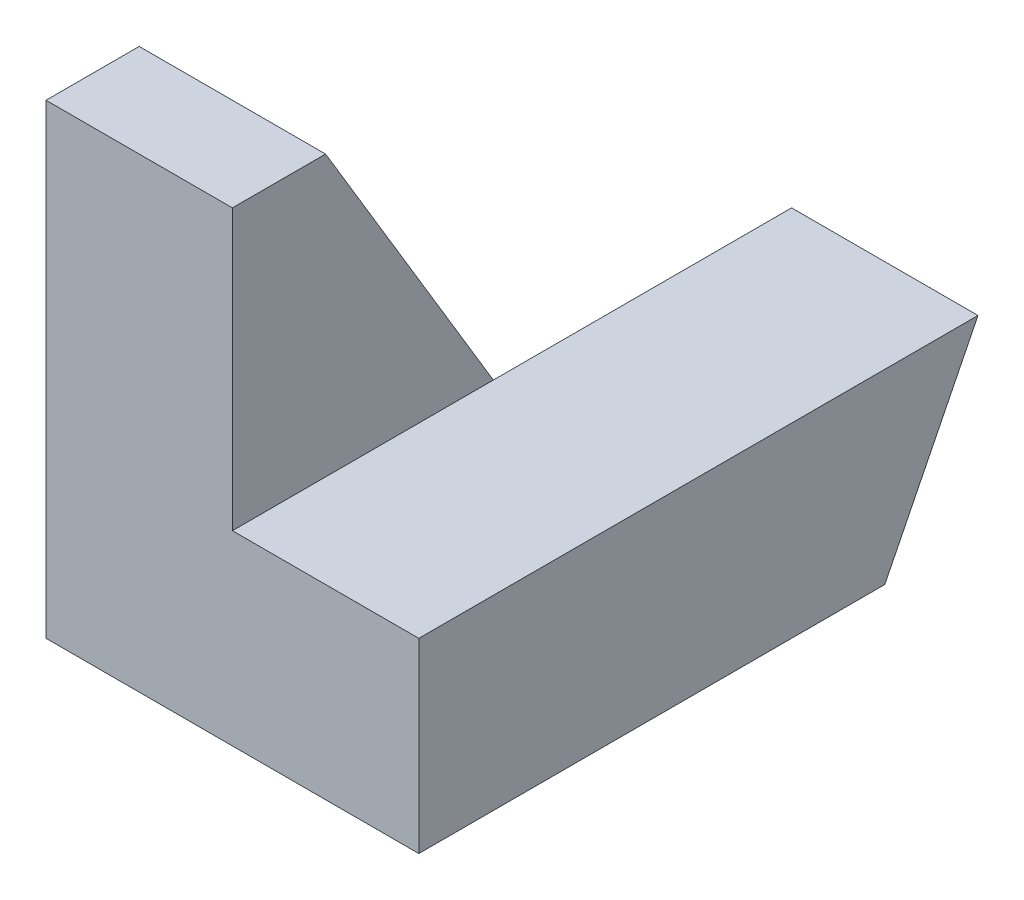
ISO-10303-21;
HEADER;
FILE_DESCRIPTION(('STEP AP214'),'2;1');
FILE_NAME('part.step','',(''),(''),'','','');
FILE_SCHEMA(('AUTOMOTIVE_DESIGN { 1 0 10303 214 1 1 1 1 }'));
ENDSEC;
DATA;
#1=APPLICATION_CONTEXT('core data for automotive mechanical design processes');
#2=APPLICATION_PROTOCOL_DEFINITION('international standard','automotive_design',2000,#1);
#3=PRODUCT_CONTEXT('',#1,'mechanical');
#4=PRODUCT('Part','Part','',(#3));
#5=PRODUCT_RELATED_PRODUCT_CATEGORY('part','',(#4));
#6=PRODUCT_DEFINITION_FORMATION('','',#4);
#7=PRODUCT_DEFINITION_CONTEXT('part definition',#1,'design');
#8=PRODUCT_DEFINITION('design','',#6,#7);
#9=PRODUCT_DEFINITION_SHAPE('','',#8);
#10=(LENGTH_UNIT() NAMED_UNIT(*) SI_UNIT(.MILLI.,.METRE.));
#11=(NAMED_UNIT(*) PLANE_ANGLE_UNIT() SI_UNIT($,.RADIAN.));
#12=(NAMED_UNIT(*) SI_UNIT($,.STERADIAN.) SOLID_ANGLE_UNIT());
#13=UNCERTAINTY_MEASURE_WITH_UNIT(LENGTH_MEASURE(1.E-05),#10,'distance_accuracy_value','');
#14=(GEOMETRIC_REPRESENTATION_CONTEXT(3) GLOBAL_UNCERTAINTY_ASSIGNED_CONTEXT((#13)) GLOBAL_UNIT_ASSIGNED_CONTEXT((#10,
#11,#12)) REPRESENTATION_CONTEXT('',''));
#15=CARTESIAN_POINT('',(0.,0.,0.));
#16=DIRECTION('',(0.,0.,1.));
#17=DIRECTION('',(1.,0.,0.));
#18=AXIS2_PLACEMENT_3D('',#15,#16,#17);
#19=CARTESIAN_POINT('',(2.,0.,0.));
#20=DIRECTION('',(-1.,0.,0.));
#21=DIRECTION('',(0.,0.,1.));
#22=AXIS2_PLACEMENT_3D('',#19,#20,#21);
#23=PLANE('',#22);
#24=DIRECTION('',(0.,0.,1.));
#25=VECTOR('',#24,1.);
#26=CARTESIAN_POINT('',(2.,2.,-6.));
#27=LINE('',#26,#25);
#28=CARTESIAN_POINT('',(2.,2.,-2.8));
#29=VERTEX_POINT('',#28);
#30=CARTESIAN_POINT('',(2.,2.,0.));
#31=VERTEX_POINT('',#30);
#32=EDGE_CURVE('E11',#29,#31,#27,.T.);
#33=ORIENTED_EDGE('',*,*,#32,.F.);
#34=DIRECTION('',(0.,0.857492925712544,0.514495755427526));
#35=VECTOR('',#34,1.);
#36=CARTESIAN_POINT('',(2.,5.,-1.));
#37=LINE('',#36,#35);
#38=CARTESIAN_POINT('',(2.,5.,-1.));
#39=VERTEX_POINT('',#38);
#40=EDGE_CURVE('E142',#29,#39,#37,.T.);
#41=ORIENTED_EDGE('',*,*,#40,.T.);
#42=DIRECTION('',(0.,0.,1.));
#43=VECTOR('',#42,1.);
#44=CARTESIAN_POINT('',(2.,5.,0.));
#45=LINE('',#44,#43);
#46=CARTESIAN_POINT('',(2.,5.,0.));
#47=VERTEX_POINT('',#46);
#48=EDGE_CURVE('E54',#39,#47,#45,.T.);
#49=ORIENTED_EDGE('',*,*,#48,.T.);
#50=DIRECTION('',(0.,-1.,0.));
#51=VECTOR('',#50,1.);
#52=CARTESIAN_POINT('',(2.,0.,0.));
#53=LINE('',#52,#51);
#54=EDGE_CURVE('E112',#47,#31,#53,.T.);
#55=ORIENTED_EDGE('',*,*,#54,.T.);
#56=EDGE_LOOP('',(#33,#41,#49,#55));
#57=FACE_BOUND('',#56,.T.);
#58=ADVANCED_FACE('F33',(#57),#23,.F.);
#59=CARTESIAN_POINT('',(2.,0.,-4.));
#60=DIRECTION('',(0.,1.,0.));
#61=DIRECTION('',(0.,0.,1.));
#62=AXIS2_PLACEMENT_3D('',#59,#60,#61);
#63=PLANE('',#62);
#64=DIRECTION('',(0.,0.,-1.));
#65=VECTOR('',#64,1.);
#66=CARTESIAN_POINT('',(0.,0.,-4.));
#67=LINE('',#66,#65);
#68=CARTESIAN_POINT('',(0.,0.,0.));
#69=VERTEX_POINT('',#68);
#70=CARTESIAN_POINT('',(0.,0.,-4.));
#71=VERTEX_POINT('',#70);
#72=EDGE_CURVE('E160',#69,#71,#67,.T.);
#73=ORIENTED_EDGE('',*,*,#72,.T.);
#74=DIRECTION('',(-1.,0.,0.));
#75=VECTOR('',#74,1.);
#76=CARTESIAN_POINT('',(2.,0.,-4.));
#77=LINE('',#76,#75);
#78=CARTESIAN_POINT('',(2.,0.,-4.));
#79=VERTEX_POINT('',#78);
#80=EDGE_CURVE('E42',#79,#71,#77,.T.);
#81=ORIENTED_EDGE('',*,*,#80,.F.);
#82=DIRECTION('',(0.,0.,-1.));
#83=VECTOR('',#82,1.);
#84=CARTESIAN_POINT('',(2.,0.,0.));
#85=LINE('',#84,#83);
#86=CARTESIAN_POINT('',(2.,0.,-5.));
#87=VERTEX_POINT('',#86);
#88=EDGE_CURVE('E138',#79,#87,#85,.T.);
#89=ORIENTED_EDGE('',*,*,#88,.T.);
#90=DIRECTION('',(-1.,0.,0.));
#91=VECTOR('',#90,1.);
#92=CARTESIAN_POINT('',(4.,0.,-5.));
#93=LINE('',#92,#91);
#94=CARTESIAN_POINT('',(4.,0.,-5.));
#95=VERTEX_POINT('',#94);
#96=EDGE_CURVE('E117',#95,#87,#93,.T.);
#97=ORIENTED_EDGE('',*,*,#96,.F.);
#98=DIRECTION('',(0.,0.,-1.));
#99=VECTOR('',#98,1.);
#100=CARTESIAN_POINT('',(4.,0.,0.));
#101=LINE('',#100,#99);
#102=CARTESIAN_POINT('',(4.,0.,0.));
#103=VERTEX_POINT('',#102);
#104=EDGE_CURVE('E115',#103,#95,#101,.T.);
#105=ORIENTED_EDGE('',*,*,#104,.F.);
#106=DIRECTION('',(-1.,0.,0.));
#107=VECTOR('',#106,1.);
#108=CARTESIAN_POINT('',(2.,0.,0.));
#109=LINE('',#108,#107);
#110=EDGE_CURVE('E102',#103,#69,#109,.T.);
#111=ORIENTED_EDGE('',*,*,#110,.T.);
#112=EDGE_LOOP('',(#73,#81,#89,#97,#105,#111));
#113=FACE_BOUND('',#112,.T.);
#114=ADVANCED_FACE('F35',(#113),#63,.F.);
#115=CARTESIAN_POINT('',(2.,5.,-1.));
#116=DIRECTION('',(0.,-0.514495755427526,0.857492925712544));
#117=DIRECTION('',(0.,-0.857492925712544,-0.514495755427526));
#118=AXIS2_PLACEMENT_3D('',#115,#116,#117);
#119=PLANE('',#118);
#120=DIRECTION('',(0.,0.857492925712544,0.514495755427526));
#121=VECTOR('',#120,1.);
#122=CARTESIAN_POINT('',(0.,5.,-1.));
#123=LINE('',#122,#121);
#124=CARTESIAN_POINT('',(0.,5.,-1.));
#125=VERTEX_POINT('',#124);
#126=EDGE_CURVE('E162',#71,#125,#123,.T.);
#127=ORIENTED_EDGE('',*,*,#126,.T.);
#128=DIRECTION('',(-1.,0.,0.));
#129=VECTOR('',#128,1.);
#130=CARTESIAN_POINT('',(2.,5.,-1.));
#131=LINE('',#130,#129);
#132=EDGE_CURVE('E150',#39,#125,#131,.T.);
#133=ORIENTED_EDGE('',*,*,#132,.F.);
#134=ORIENTED_EDGE('',*,*,#40,.F.);
#135=EDGE_CURVE('E81',#79,#29,#37,.T.);
#136=ORIENTED_EDGE('',*,*,#135,.F.);
#137=ORIENTED_EDGE('',*,*,#80,.T.);
#138=EDGE_LOOP('',(#127,#133,#134,#136,#137));
#139=FACE_BOUND('',#138,.T.);
#140=ADVANCED_FACE('F197',(#139),#119,.F.);
#141=CARTESIAN_POINT('',(2.,5.,0.));
#142=DIRECTION('',(0.,-1.,0.));
#143=DIRECTION('',(0.,0.,-1.));
#144=AXIS2_PLACEMENT_3D('',#141,#142,#143);
#145=PLANE('',#144);
#146=DIRECTION('',(0.,0.,1.));
#147=VECTOR('',#146,1.);
#148=CARTESIAN_POINT('',(0.,5.,0.));
#149=LINE('',#148,#147);
#150=CARTESIAN_POINT('',(0.,5.,0.));
#151=VERTEX_POINT('',#150);
#152=EDGE_CURVE('E164',#125,#151,#149,.T.);
#153=ORIENTED_EDGE('',*,*,#152,.T.);
#154=DIRECTION('',(-1.,0.,0.));
#155=VECTOR('',#154,1.);
#156=CARTESIAN_POINT('',(2.,5.,0.));
#157=LINE('',#156,#155);
#158=EDGE_CURVE('E111',#47,#151,#157,.T.);
#159=ORIENTED_EDGE('',*,*,#158,.F.);
#160=ORIENTED_EDGE('',*,*,#48,.F.);
#161=ORIENTED_EDGE('',*,*,#132,.T.);
#162=EDGE_LOOP('',(#153,#159,#160,#161));
#163=FACE_BOUND('',#162,.T.);
#164=ADVANCED_FACE('F166',(#163),#145,.F.);
#165=CARTESIAN_POINT('',(2.,0.,0.));
#166=DIRECTION('',(0.,0.,-1.));
#167=DIRECTION('',(-1.,0.,0.));
#168=AXIS2_PLACEMENT_3D('',#165,#166,#167);
#169=PLANE('',#168);
#170=DIRECTION('',(0.,-1.,0.));
#171=VECTOR('',#170,1.);
#172=CARTESIAN_POINT('',(0.,0.,0.));
#173=LINE('',#172,#171);
#174=EDGE_CURVE('E75',#151,#69,#173,.T.);
#175=ORIENTED_EDGE('',*,*,#174,.T.);
#176=ORIENTED_EDGE('',*,*,#110,.F.);
#177=DIRECTION('',(0.,-1.,0.));
#178=VECTOR('',#177,1.);
#179=CARTESIAN_POINT('',(4.,2.,0.));
#180=LINE('',#179,#178);
#181=CARTESIAN_POINT('',(4.,2.,0.));
#182=VERTEX_POINT('',#181);
#183=EDGE_CURVE('E107',#182,#103,#180,.T.);
#184=ORIENTED_EDGE('',*,*,#183,.F.);
#185=DIRECTION('',(-1.,0.,0.));
#186=VECTOR('',#185,1.);
#187=CARTESIAN_POINT('',(4.,2.,0.));
#188=LINE('',#187,#186);
#189=EDGE_CURVE('E134',#182,#31,#188,.T.);
#190=ORIENTED_EDGE('',*,*,#189,.T.);
#191=ORIENTED_EDGE('',*,*,#54,.F.);
#192=ORIENTED_EDGE('',*,*,#158,.T.);
#193=EDGE_LOOP('',(#175,#176,#184,#190,#191,#192));
#194=FACE_BOUND('',#193,.T.);
#195=ADVANCED_FACE('F104',(#194),#169,.F.);
#196=CARTESIAN_POINT('',(0.,0.,0.));
#197=DIRECTION('',(-1.,0.,0.));
#198=DIRECTION('',(0.,0.,1.));
#199=AXIS2_PLACEMENT_3D('',#196,#197,#198);
#200=PLANE('',#199);
#201=ORIENTED_EDGE('',*,*,#72,.F.);
#202=ORIENTED_EDGE('',*,*,#174,.F.);
#203=ORIENTED_EDGE('',*,*,#152,.F.);
#204=ORIENTED_EDGE('',*,*,#126,.F.);
#205=EDGE_LOOP('',(#201,#202,#203,#204));
#206=FACE_BOUND('',#205,.T.);
#207=ADVANCED_FACE('F169',(#206),#200,.T.);
#208=CARTESIAN_POINT('',(2.,0.,0.));
#209=DIRECTION('',(1.,0.,0.));
#210=DIRECTION('',(0.,0.,-1.));
#211=AXIS2_PLACEMENT_3D('',#208,#209,#210);
#212=PLANE('',#211);
#213=ORIENTED_EDGE('',*,*,#88,.F.);
#214=ORIENTED_EDGE('',*,*,#135,.T.);
#215=CARTESIAN_POINT('',(2.,2.,-6.));
#216=VERTEX_POINT('',#215);
#217=EDGE_CURVE('E126',#216,#29,#27,.T.);
#218=ORIENTED_EDGE('',*,*,#217,.F.);
#219=DIRECTION('',(0.,0.894427190999916,-0.447213595499958));
#220=VECTOR('',#219,1.);
#221=CARTESIAN_POINT('',(2.,0.,-5.));
#222=LINE('',#221,#220);
#223=EDGE_CURVE('E129',#87,#216,#222,.T.);
#224=ORIENTED_EDGE('',*,*,#223,.F.);
#225=EDGE_LOOP('',(#213,#214,#218,#224));
#226=FACE_BOUND('',#225,.T.);
#227=ADVANCED_FACE('F173',(#226),#212,.F.);
#228=CARTESIAN_POINT('',(4.,0.,-5.));
#229=DIRECTION('',(0.,0.447213595499958,0.894427190999916));
#230=DIRECTION('',(0.,-0.894427190999916,0.447213595499958));
#231=AXIS2_PLACEMENT_3D('',#228,#229,#230);
#232=PLANE('',#231);
#233=ORIENTED_EDGE('',*,*,#223,.T.);
#234=DIRECTION('',(-1.,0.,0.));
#235=VECTOR('',#234,1.);
#236=CARTESIAN_POINT('',(4.,2.,-6.));
#237=LINE('',#236,#235);
#238=CARTESIAN_POINT('',(4.,2.,-6.));
#239=VERTEX_POINT('',#238);
#240=EDGE_CURVE('E179',#239,#216,#237,.T.);
#241=ORIENTED_EDGE('',*,*,#240,.F.);
#242=DIRECTION('',(0.,0.894427190999916,-0.447213595499958));
#243=VECTOR('',#242,1.);
#244=CARTESIAN_POINT('',(4.,0.,-5.));
#245=LINE('',#244,#243);
#246=EDGE_CURVE('E120',#95,#239,#245,.T.);
#247=ORIENTED_EDGE('',*,*,#246,.F.);
#248=ORIENTED_EDGE('',*,*,#96,.T.);
#249=EDGE_LOOP('',(#233,#241,#247,#248));
#250=FACE_BOUND('',#249,.T.);
#251=ADVANCED_FACE('F178',(#250),#232,.F.);
#252=CARTESIAN_POINT('',(4.,2.,-6.));
#253=DIRECTION('',(0.,-1.,0.));
#254=DIRECTION('',(0.,0.,-1.));
#255=AXIS2_PLACEMENT_3D('',#252,#253,#254);
#256=PLANE('',#255);
#257=ORIENTED_EDGE('',*,*,#217,.T.);
#258=ORIENTED_EDGE('',*,*,#32,.T.);
#259=ORIENTED_EDGE('',*,*,#189,.F.);
#260=DIRECTION('',(0.,0.,1.));
#261=VECTOR('',#260,1.);
#262=CARTESIAN_POINT('',(4.,2.,-6.));
#263=LINE('',#262,#261);
#264=EDGE_CURVE('E124',#239,#182,#263,.T.);
#265=ORIENTED_EDGE('',*,*,#264,.F.);
#266=ORIENTED_EDGE('',*,*,#240,.T.);
#267=EDGE_LOOP('',(#257,#258,#259,#265,#266));
#268=FACE_BOUND('',#267,.T.);
#269=ADVANCED_FACE('F181',(#268),#256,.F.);
#270=CARTESIAN_POINT('',(4.,0.,0.));
#271=DIRECTION('',(1.,0.,0.));
#272=DIRECTION('',(0.,0.,-1.));
#273=AXIS2_PLACEMENT_3D('',#270,#271,#272);
#274=PLANE('',#273);
#275=ORIENTED_EDGE('',*,*,#183,.T.);
#276=ORIENTED_EDGE('',*,*,#104,.T.);
#277=ORIENTED_EDGE('',*,*,#246,.T.);
#278=ORIENTED_EDGE('',*,*,#264,.T.);
#279=EDGE_LOOP('',(#275,#276,#277,#278));
#280=FACE_BOUND('',#279,.T.);
#281=ADVANCED_FACE('F122',(#280),#274,.T.);
#282=CLOSED_SHELL('',(#58,#114,#140,#164,#195,#207,#227,#251,#269,#281));
#283=MANIFOLD_SOLID_BREP('B2',#282);
#284=ADVANCED_BREP_SHAPE_REPRESENTATION('',(#18,#283),#14);
#285=SHAPE_DEFINITION_REPRESENTATION(#9,#284);
ENDSEC;
END-ISO-10303-21;
